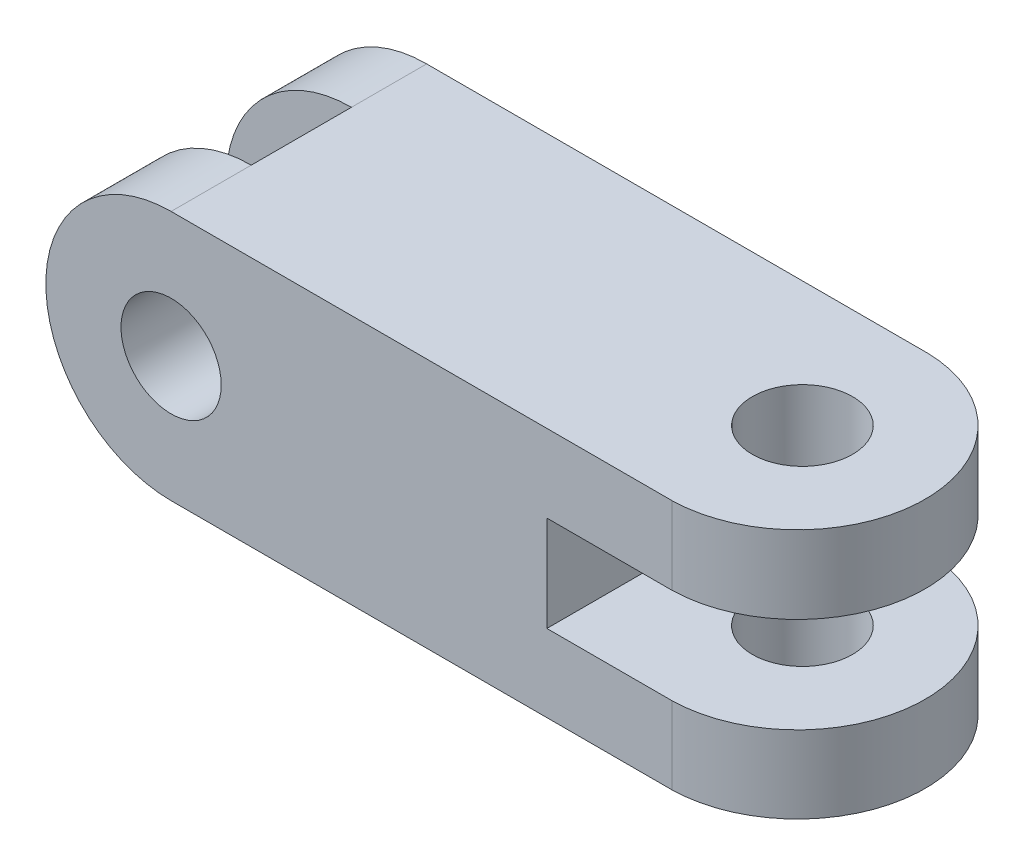
ISO-10303-21;
HEADER;
FILE_DESCRIPTION(('STEP AP214'),'2;1');
FILE_NAME('part.step','',(''),(''),'','','');
FILE_SCHEMA(('AUTOMOTIVE_DESIGN { 1 0 10303 214 1 1 1 1 }'));
ENDSEC;
DATA;
#1=APPLICATION_CONTEXT('core data for automotive mechanical design processes');
#2=APPLICATION_PROTOCOL_DEFINITION('international standard','automotive_design',2000,#1);
#3=PRODUCT_CONTEXT('',#1,'mechanical');
#4=PRODUCT('Part','Part','',(#3));
#5=PRODUCT_RELATED_PRODUCT_CATEGORY('part','',(#4));
#6=PRODUCT_DEFINITION_FORMATION('','',#4);
#7=PRODUCT_DEFINITION_CONTEXT('part definition',#1,'design');
#8=PRODUCT_DEFINITION('design','',#6,#7);
#9=PRODUCT_DEFINITION_SHAPE('','',#8);
#10=(LENGTH_UNIT() NAMED_UNIT(*) SI_UNIT(.MILLI.,.METRE.));
#11=(NAMED_UNIT(*) PLANE_ANGLE_UNIT() SI_UNIT($,.RADIAN.));
#12=(NAMED_UNIT(*) SI_UNIT($,.STERADIAN.) SOLID_ANGLE_UNIT());
#13=UNCERTAINTY_MEASURE_WITH_UNIT(LENGTH_MEASURE(1.E-05),#10,'distance_accuracy_value','');
#14=(GEOMETRIC_REPRESENTATION_CONTEXT(3) GLOBAL_UNCERTAINTY_ASSIGNED_CONTEXT((#13)) GLOBAL_UNIT_ASSIGNED_CONTEXT((#10,
#11,#12)) REPRESENTATION_CONTEXT('',''));
#15=CARTESIAN_POINT('',(0.,0.,0.));
#16=DIRECTION('',(0.,0.,1.));
#17=DIRECTION('',(1.,0.,0.));
#18=AXIS2_PLACEMENT_3D('',#15,#16,#17);
#19=CARTESIAN_POINT('',(-34.5326879287548,3.20944540727913,-0.999999999999997));
#20=DIRECTION('',(0.,1.,0.));
#21=DIRECTION('',(0.,0.,1.));
#22=AXIS2_PLACEMENT_3D('',#19,#20,#21);
#23=PLANE('',#22);
#24=CARTESIAN_POINT('',(65.4673120712452,3.20944540727913,24.));
#25=DIRECTION('',(0.,1.,0.));
#26=DIRECTION('',(0.,0.,1.));
#27=AXIS2_PLACEMENT_3D('',#24,#25,#26);
#28=CIRCLE('',#27,9.99999999999999);
#29=CARTESIAN_POINT('',(65.4673120712452,3.20944540727913,34.));
#30=VERTEX_POINT('',#29);
#31=EDGE_CURVE('E235',#30,#30,#28,.T.);
#32=ORIENTED_EDGE('',*,*,#31,.F.);
#33=EDGE_LOOP('',(#32));
#34=FACE_BOUND('',#33,.T.);
#35=CARTESIAN_POINT('',(64.9623120712452,3.20944540727913,24.5));
#36=DIRECTION('',(0.,1.,0.));
#37=DIRECTION('',(0.,0.,1.));
#38=AXIS2_PLACEMENT_3D('',#35,#36,#37);
#39=CIRCLE('',#38,25.505);
#40=CARTESIAN_POINT('',(65.4673120712454,3.20944540727913,-0.999999999999997));
#41=VERTEX_POINT('',#40);
#42=CARTESIAN_POINT('',(65.4673120712453,3.20944540727913,50.));
#43=VERTEX_POINT('',#42);
#44=EDGE_CURVE('E157',#41,#43,#39,.F.);
#45=ORIENTED_EDGE('',*,*,#44,.F.);
#46=DIRECTION('',(-1.,0.,0.));
#47=VECTOR('',#46,1.);
#48=CARTESIAN_POINT('',(-34.5326879287548,3.20944540727913,-0.999999999999997));
#49=LINE('',#48,#47);
#50=CARTESIAN_POINT('',(-34.5326879287548,3.20944540727913,-0.999999999999997));
#51=VERTEX_POINT('',#50);
#52=EDGE_CURVE('E186',#41,#51,#49,.T.);
#53=ORIENTED_EDGE('',*,*,#52,.T.);
#54=DIRECTION('',(0.,0.,1.));
#55=VECTOR('',#54,1.);
#56=CARTESIAN_POINT('',(-34.5326879287548,3.20944540727913,-0.999999999999997));
#57=LINE('',#56,#55);
#58=CARTESIAN_POINT('',(-34.5326879287548,3.20944540727913,14.));
#59=VERTEX_POINT('',#58);
#60=EDGE_CURVE('E189',#51,#59,#57,.T.);
#61=ORIENTED_EDGE('',*,*,#60,.T.);
#62=DIRECTION('',(0.,0.,1.));
#63=VECTOR('',#62,1.);
#64=CARTESIAN_POINT('',(-34.5326879287548,3.20944540727913,0.));
#65=LINE('',#64,#63);
#66=CARTESIAN_POINT('',(-34.5326879287548,3.20944540727913,34.));
#67=VERTEX_POINT('',#66);
#68=EDGE_CURVE('E220',#59,#67,#65,.T.);
#69=ORIENTED_EDGE('',*,*,#68,.T.);
#70=CARTESIAN_POINT('',(-34.5326879287548,3.20944540727913,50.));
#71=VERTEX_POINT('',#70);
#72=EDGE_CURVE('E193',#67,#71,#57,.T.);
#73=ORIENTED_EDGE('',*,*,#72,.T.);
#74=DIRECTION('',(-1.,0.,0.));
#75=VECTOR('',#74,1.);
#76=CARTESIAN_POINT('',(-34.5326879287548,3.20944540727913,50.));
#77=LINE('',#76,#75);
#78=EDGE_CURVE('E271',#43,#71,#77,.T.);
#79=ORIENTED_EDGE('',*,*,#78,.F.);
#80=EDGE_LOOP('',(#45,#53,#61,#69,#73,#79));
#81=FACE_BOUND('',#80,.T.);
#82=ADVANCED_FACE('F57',(#34,#81),#23,.T.);
#83=CARTESIAN_POINT('',(90.4673120712452,-12.2905545927209,-0.999999999999997));
#84=DIRECTION('',(0.,-1.,0.));
#85=DIRECTION('',(1.,0.,0.));
#86=AXIS2_PLACEMENT_3D('',#83,#84,#85);
#87=PLANE('',#86);
#88=CARTESIAN_POINT('',(65.4673120712452,-12.2905545927209,24.));
#89=DIRECTION('',(0.,-1.,0.));
#90=DIRECTION('',(1.,0.,0.));
#91=AXIS2_PLACEMENT_3D('',#88,#89,#90);
#92=CIRCLE('',#91,9.99999999999999);
#93=CARTESIAN_POINT('',(75.4673120712452,-12.2905545927209,24.));
#94=VERTEX_POINT('',#93);
#95=EDGE_CURVE('E252',#94,#94,#92,.T.);
#96=ORIENTED_EDGE('',*,*,#95,.F.);
#97=EDGE_LOOP('',(#96));
#98=FACE_BOUND('',#97,.T.);
#99=DIRECTION('',(1.,0.,0.));
#100=VECTOR('',#99,1.);
#101=CARTESIAN_POINT('',(90.4673120712452,-12.2905545927209,-0.999999999999997));
#102=LINE('',#101,#100);
#103=CARTESIAN_POINT('',(40.4673120712452,-12.2905545927209,-0.999999999999997));
#104=VERTEX_POINT('',#103);
#105=CARTESIAN_POINT('',(65.4673120712454,-12.2905545927209,-0.999999999999997));
#106=VERTEX_POINT('',#105);
#107=EDGE_CURVE('E183',#104,#106,#102,.T.);
#108=ORIENTED_EDGE('',*,*,#107,.T.);
#109=CARTESIAN_POINT('',(64.9623120712452,-12.2905545927209,24.5));
#110=DIRECTION('',(0.,-1.,0.));
#111=DIRECTION('',(1.,0.,0.));
#112=AXIS2_PLACEMENT_3D('',#109,#110,#111);
#113=CIRCLE('',#112,25.505);
#114=CARTESIAN_POINT('',(65.4673120712453,-12.2905545927209,50.));
#115=VERTEX_POINT('',#114);
#116=EDGE_CURVE('E243',#115,#106,#113,.F.);
#117=ORIENTED_EDGE('',*,*,#116,.F.);
#118=DIRECTION('',(1.,0.,0.));
#119=VECTOR('',#118,1.);
#120=CARTESIAN_POINT('',(90.4673120712452,-12.2905545927209,50.));
#121=LINE('',#120,#119);
#122=CARTESIAN_POINT('',(40.4673120712452,-12.2905545927209,50.));
#123=VERTEX_POINT('',#122);
#124=EDGE_CURVE('E268',#123,#115,#121,.T.);
#125=ORIENTED_EDGE('',*,*,#124,.F.);
#126=DIRECTION('',(0.,0.,1.));
#127=VECTOR('',#126,1.);
#128=CARTESIAN_POINT('',(40.4673120712452,-12.2905545927209,-0.999999999999997));
#129=LINE('',#128,#127);
#130=EDGE_CURVE('E194',#104,#123,#129,.T.);
#131=ORIENTED_EDGE('',*,*,#130,.F.);
#132=EDGE_LOOP('',(#108,#117,#125,#131));
#133=FACE_BOUND('',#132,.T.);
#134=ADVANCED_FACE('F291',(#98,#133),#87,.T.);
#135=CARTESIAN_POINT('',(40.4673120712452,-31.3735701906411,-0.999999999999997));
#136=DIRECTION('',(0.,1.,0.));
#137=DIRECTION('',(-1.,0.,0.));
#138=AXIS2_PLACEMENT_3D('',#135,#136,#137);
#139=PLANE('',#138);
#140=CARTESIAN_POINT('',(65.4673120712452,-31.3735701906411,24.));
#141=DIRECTION('',(0.,1.,0.));
#142=DIRECTION('',(-1.,0.,0.));
#143=AXIS2_PLACEMENT_3D('',#140,#141,#142);
#144=CIRCLE('',#143,9.99999999999999);
#145=CARTESIAN_POINT('',(55.4673120712452,-31.3735701906411,24.));
#146=VERTEX_POINT('',#145);
#147=EDGE_CURVE('E249',#146,#146,#144,.T.);
#148=ORIENTED_EDGE('',*,*,#147,.F.);
#149=EDGE_LOOP('',(#148));
#150=FACE_BOUND('',#149,.T.);
#151=CARTESIAN_POINT('',(64.9623120712452,-31.3735701906411,24.5));
#152=DIRECTION('',(0.,1.,0.));
#153=DIRECTION('',(-1.,0.,0.));
#154=AXIS2_PLACEMENT_3D('',#151,#152,#153);
#155=CIRCLE('',#154,25.505);
#156=CARTESIAN_POINT('',(65.4673120712454,-31.3735701906411,-0.999999999999997));
#157=VERTEX_POINT('',#156);
#158=CARTESIAN_POINT('',(65.4673120712453,-31.3735701906411,50.));
#159=VERTEX_POINT('',#158);
#160=EDGE_CURVE('E241',#157,#159,#155,.F.);
#161=ORIENTED_EDGE('',*,*,#160,.F.);
#162=DIRECTION('',(-1.,0.,0.));
#163=VECTOR('',#162,1.);
#164=CARTESIAN_POINT('',(40.4673120712452,-31.3735701906411,-0.999999999999997));
#165=LINE('',#164,#163);
#166=CARTESIAN_POINT('',(40.4673120712452,-31.3735701906411,-0.999999999999997));
#167=VERTEX_POINT('',#166);
#168=EDGE_CURVE('E167',#157,#167,#165,.T.);
#169=ORIENTED_EDGE('',*,*,#168,.T.);
#170=DIRECTION('',(0.,0.,1.));
#171=VECTOR('',#170,1.);
#172=CARTESIAN_POINT('',(40.4673120712452,-31.3735701906411,-0.999999999999997));
#173=LINE('',#172,#171);
#174=CARTESIAN_POINT('',(40.4673120712452,-31.3735701906411,50.));
#175=VERTEX_POINT('',#174);
#176=EDGE_CURVE('E196',#167,#175,#173,.T.);
#177=ORIENTED_EDGE('',*,*,#176,.T.);
#178=DIRECTION('',(-1.,0.,0.));
#179=VECTOR('',#178,1.);
#180=CARTESIAN_POINT('',(40.4673120712452,-31.3735701906411,50.));
#181=LINE('',#180,#179);
#182=EDGE_CURVE('E263',#159,#175,#181,.T.);
#183=ORIENTED_EDGE('',*,*,#182,.F.);
#184=EDGE_LOOP('',(#161,#169,#177,#183));
#185=FACE_BOUND('',#184,.T.);
#186=ADVANCED_FACE('F297',(#150,#185),#139,.T.);
#187=CARTESIAN_POINT('',(-34.5326879287548,-46.7905545927209,-0.999999999999997));
#188=DIRECTION('',(0.,-1.,0.));
#189=DIRECTION('',(0.,0.,-1.));
#190=AXIS2_PLACEMENT_3D('',#187,#188,#189);
#191=PLANE('',#190);
#192=CARTESIAN_POINT('',(65.4673120712452,-46.7905545927209,24.));
#193=DIRECTION('',(0.,1.,0.));
#194=DIRECTION('',(0.,0.,1.));
#195=AXIS2_PLACEMENT_3D('',#192,#193,#194);
#196=CIRCLE('',#195,9.99999999999999);
#197=CARTESIAN_POINT('',(65.4673120712452,-46.7905545927209,34.));
#198=VERTEX_POINT('',#197);
#199=EDGE_CURVE('E236',#198,#198,#196,.T.);
#200=ORIENTED_EDGE('',*,*,#199,.T.);
#201=EDGE_LOOP('',(#200));
#202=FACE_BOUND('',#201,.T.);
#203=DIRECTION('',(1.,0.,0.));
#204=VECTOR('',#203,1.);
#205=CARTESIAN_POINT('',(-34.5326879287548,-46.7905545927209,-0.999999999999997));
#206=LINE('',#205,#204);
#207=CARTESIAN_POINT('',(-34.5326879287548,-46.7905545927209,-0.999999999999997));
#208=VERTEX_POINT('',#207);
#209=CARTESIAN_POINT('',(65.4673120712454,-46.7905545927209,-0.999999999999997));
#210=VERTEX_POINT('',#209);
#211=EDGE_CURVE('E164',#208,#210,#206,.T.);
#212=ORIENTED_EDGE('',*,*,#211,.T.);
#213=CARTESIAN_POINT('',(64.9623120712452,-46.7905545927209,24.5));
#214=DIRECTION('',(0.,1.,0.));
#215=DIRECTION('',(0.,0.,1.));
#216=AXIS2_PLACEMENT_3D('',#213,#214,#215);
#217=CIRCLE('',#216,25.505);
#218=CARTESIAN_POINT('',(65.4673120712453,-46.7905545927209,50.));
#219=VERTEX_POINT('',#218);
#220=EDGE_CURVE('E146',#210,#219,#217,.F.);
#221=ORIENTED_EDGE('',*,*,#220,.T.);
#222=DIRECTION('',(1.,0.,0.));
#223=VECTOR('',#222,1.);
#224=CARTESIAN_POINT('',(-34.5326879287548,-46.7905545927209,50.));
#225=LINE('',#224,#223);
#226=CARTESIAN_POINT('',(-34.5326879287548,-46.7905545927209,50.));
#227=VERTEX_POINT('',#226);
#228=EDGE_CURVE('E261',#227,#219,#225,.T.);
#229=ORIENTED_EDGE('',*,*,#228,.F.);
#230=DIRECTION('',(0.,0.,1.));
#231=VECTOR('',#230,1.);
#232=CARTESIAN_POINT('',(-34.5326879287548,-46.7905545927209,-0.999999999999997));
#233=LINE('',#232,#231);
#234=CARTESIAN_POINT('',(-34.5326879287548,-46.7905545927209,34.));
#235=VERTEX_POINT('',#234);
#236=EDGE_CURVE('E188',#235,#227,#233,.T.);
#237=ORIENTED_EDGE('',*,*,#236,.F.);
#238=DIRECTION('',(0.,0.,1.));
#239=VECTOR('',#238,1.);
#240=CARTESIAN_POINT('',(-34.5326879287548,-46.7905545927209,0.));
#241=LINE('',#240,#239);
#242=CARTESIAN_POINT('',(-34.5326879287548,-46.7905545927209,14.));
#243=VERTEX_POINT('',#242);
#244=EDGE_CURVE('E229',#243,#235,#241,.T.);
#245=ORIENTED_EDGE('',*,*,#244,.F.);
#246=EDGE_CURVE('E172',#208,#243,#233,.T.);
#247=ORIENTED_EDGE('',*,*,#246,.F.);
#248=EDGE_LOOP('',(#212,#221,#229,#237,#245,#247));
#249=FACE_BOUND('',#248,.T.);
#250=ADVANCED_FACE('F169',(#202,#249),#191,.T.);
#251=CARTESIAN_POINT('',(-34.5326879287548,-21.7905545927209,-0.999999999999997));
#252=DIRECTION('',(0.,0.,1.));
#253=DIRECTION('',(1.,0.,0.));
#254=AXIS2_PLACEMENT_3D('',#251,#252,#253);
#255=CYLINDRICAL_SURFACE('',#254,25.);
#256=ORIENTED_EDGE('',*,*,#246,.T.);
#257=CARTESIAN_POINT('',(-34.5326879287548,-21.7905545927209,14.));
#258=DIRECTION('',(0.,0.,1.));
#259=DIRECTION('',(1.,0.,0.));
#260=AXIS2_PLACEMENT_3D('',#257,#258,#259);
#261=CIRCLE('',#260,25.);
#262=EDGE_CURVE('E247',#243,#59,#261,.F.);
#263=ORIENTED_EDGE('',*,*,#262,.T.);
#264=ORIENTED_EDGE('',*,*,#60,.F.);
#265=CARTESIAN_POINT('',(-34.5326879287548,-21.7905545927209,-0.999999999999997));
#266=DIRECTION('',(0.,0.,1.));
#267=DIRECTION('',(1.,0.,0.));
#268=AXIS2_PLACEMENT_3D('',#265,#266,#267);
#269=CIRCLE('',#268,25.);
#270=EDGE_CURVE('E173',#51,#208,#269,.T.);
#271=ORIENTED_EDGE('',*,*,#270,.T.);
#272=EDGE_LOOP('',(#256,#263,#264,#271));
#273=FACE_BOUND('',#272,.T.);
#274=ADVANCED_FACE('F278',(#273),#255,.T.);
#275=CARTESIAN_POINT('',(-34.5326879287548,-21.7905545927209,-0.999999999999997));
#276=DIRECTION('',(0.,0.,1.));
#277=DIRECTION('',(1.,0.,0.));
#278=AXIS2_PLACEMENT_3D('',#275,#276,#277);
#279=CYLINDRICAL_SURFACE('',#278,10.);
#280=CARTESIAN_POINT('',(-34.5326879287548,-21.7905545927209,50.));
#281=DIRECTION('',(0.,0.,1.));
#282=DIRECTION('',(1.,0.,0.));
#283=AXIS2_PLACEMENT_3D('',#280,#281,#282);
#284=CIRCLE('',#283,10.);
#285=CARTESIAN_POINT('',(-24.5326879287548,-21.7905545927209,50.));
#286=VERTEX_POINT('',#285);
#287=EDGE_CURVE('E255',#286,#286,#284,.T.);
#288=ORIENTED_EDGE('',*,*,#287,.T.);
#289=EDGE_LOOP('',(#288));
#290=FACE_BOUND('',#289,.T.);
#291=CARTESIAN_POINT('',(-34.5326879287548,-21.7905545927209,-0.999999999999997));
#292=DIRECTION('',(0.,0.,1.));
#293=DIRECTION('',(1.,0.,0.));
#294=AXIS2_PLACEMENT_3D('',#291,#292,#293);
#295=CIRCLE('',#294,10.);
#296=CARTESIAN_POINT('',(-24.5326879287548,-21.7905545927209,-0.999999999999997));
#297=VERTEX_POINT('',#296);
#298=EDGE_CURVE('E177',#297,#297,#295,.T.);
#299=ORIENTED_EDGE('',*,*,#298,.F.);
#300=EDGE_LOOP('',(#299));
#301=FACE_BOUND('',#300,.T.);
#302=CARTESIAN_POINT('',(-34.5326879287548,-21.7905545927209,14.));
#303=DIRECTION('',(0.,0.,1.));
#304=DIRECTION('',(1.,0.,0.));
#305=AXIS2_PLACEMENT_3D('',#302,#303,#304);
#306=CIRCLE('',#305,10.);
#307=CARTESIAN_POINT('',(-34.5326879287548,-31.7905545927209,14.));
#308=VERTEX_POINT('',#307);
#309=CARTESIAN_POINT('',(-34.5326879287548,-11.7905545927209,14.));
#310=VERTEX_POINT('',#309);
#311=EDGE_CURVE('E65',#308,#310,#306,.F.);
#312=ORIENTED_EDGE('',*,*,#311,.F.);
#313=DIRECTION('',(0.,0.,1.));
#314=VECTOR('',#313,1.);
#315=CARTESIAN_POINT('',(-34.5326879287548,-31.7905545927209,-0.999999999999997));
#316=LINE('',#315,#314);
#317=CARTESIAN_POINT('',(-34.5326879287548,-31.7905545927209,34.));
#318=VERTEX_POINT('',#317);
#319=EDGE_CURVE('E206',#318,#308,#316,.F.);
#320=ORIENTED_EDGE('',*,*,#319,.F.);
#321=CARTESIAN_POINT('',(-34.5326879287548,-21.7905545927209,34.));
#322=DIRECTION('',(0.,0.,1.));
#323=DIRECTION('',(1.,0.,0.));
#324=AXIS2_PLACEMENT_3D('',#321,#322,#323);
#325=CIRCLE('',#324,10.);
#326=CARTESIAN_POINT('',(-34.5326879287548,-11.7905545927209,34.));
#327=VERTEX_POINT('',#326);
#328=EDGE_CURVE('E201',#318,#327,#325,.F.);
#329=ORIENTED_EDGE('',*,*,#328,.T.);
#330=DIRECTION('',(0.,0.,1.));
#331=VECTOR('',#330,1.);
#332=CARTESIAN_POINT('',(-34.5326879287548,-11.7905545927209,-0.999999999999997));
#333=LINE('',#332,#331);
#334=EDGE_CURVE('E204',#310,#327,#333,.T.);
#335=ORIENTED_EDGE('',*,*,#334,.F.);
#336=EDGE_LOOP('',(#312,#320,#329,#335));
#337=FACE_BOUND('',#336,.T.);
#338=ADVANCED_FACE('F223',(#290,#301,#337),#279,.F.);
#339=CARTESIAN_POINT('',(-34.5326879287548,-21.7905545927209,34.));
#340=DIRECTION('',(0.,0.,1.));
#341=DIRECTION('',(1.,0.,0.));
#342=AXIS2_PLACEMENT_3D('',#339,#340,#341);
#343=CIRCLE('',#342,25.);
#344=EDGE_CURVE('E245',#235,#67,#343,.F.);
#345=ORIENTED_EDGE('',*,*,#344,.F.);
#346=ORIENTED_EDGE('',*,*,#236,.T.);
#347=CARTESIAN_POINT('',(-34.5326879287548,-21.7905545927209,50.));
#348=DIRECTION('',(0.,0.,1.));
#349=DIRECTION('',(1.,0.,0.));
#350=AXIS2_PLACEMENT_3D('',#347,#348,#349);
#351=CIRCLE('',#350,25.);
#352=EDGE_CURVE('E258',#71,#227,#351,.T.);
#353=ORIENTED_EDGE('',*,*,#352,.F.);
#354=ORIENTED_EDGE('',*,*,#72,.F.);
#355=EDGE_LOOP('',(#345,#346,#353,#354));
#356=FACE_BOUND('',#355,.T.);
#357=ADVANCED_FACE('F59',(#356),#255,.T.);
#358=CARTESIAN_POINT('',(40.4673120712452,-12.2905545927209,-0.999999999999997));
#359=DIRECTION('',(1.,0.,0.));
#360=DIRECTION('',(0.,0.,-1.));
#361=AXIS2_PLACEMENT_3D('',#358,#359,#360);
#362=PLANE('',#361);
#363=ORIENTED_EDGE('',*,*,#130,.T.);
#364=DIRECTION('',(0.,1.,0.));
#365=VECTOR('',#364,1.);
#366=CARTESIAN_POINT('',(40.4673120712452,-12.2905545927209,50.));
#367=LINE('',#366,#365);
#368=EDGE_CURVE('E265',#175,#123,#367,.T.);
#369=ORIENTED_EDGE('',*,*,#368,.F.);
#370=ORIENTED_EDGE('',*,*,#176,.F.);
#371=DIRECTION('',(0.,1.,0.));
#372=VECTOR('',#371,1.);
#373=CARTESIAN_POINT('',(40.4673120712452,-12.2905545927209,-0.999999999999997));
#374=LINE('',#373,#372);
#375=EDGE_CURVE('E175',#167,#104,#374,.T.);
#376=ORIENTED_EDGE('',*,*,#375,.T.);
#377=EDGE_LOOP('',(#363,#369,#370,#376));
#378=FACE_BOUND('',#377,.T.);
#379=ADVANCED_FACE('F285',(#378),#362,.T.);
#380=CARTESIAN_POINT('',(-34.5326879287548,-21.7905545927209,-0.999999999999997));
#381=DIRECTION('',(0.,0.,1.));
#382=DIRECTION('',(1.,0.,0.));
#383=AXIS2_PLACEMENT_3D('',#380,#381,#382);
#384=PLANE('',#383);
#385=ORIENTED_EDGE('',*,*,#298,.T.);
#386=EDGE_LOOP('',(#385));
#387=FACE_BOUND('',#386,.T.);
#388=ORIENTED_EDGE('',*,*,#52,.F.);
#389=DIRECTION('',(0.,1.,0.));
#390=VECTOR('',#389,1.);
#391=CARTESIAN_POINT('',(65.4673120712454,-46.7905545927209,-0.999999999999997));
#392=LINE('',#391,#390);
#393=EDGE_CURVE('E12',#41,#106,#392,.F.);
#394=ORIENTED_EDGE('',*,*,#393,.T.);
#395=ORIENTED_EDGE('',*,*,#107,.F.);
#396=ORIENTED_EDGE('',*,*,#375,.F.);
#397=ORIENTED_EDGE('',*,*,#168,.F.);
#398=DIRECTION('',(0.,1.,0.));
#399=VECTOR('',#398,1.);
#400=CARTESIAN_POINT('',(65.4673120712454,-46.7905545927209,-0.999999999999997));
#401=LINE('',#400,#399);
#402=EDGE_CURVE('E149',#210,#157,#401,.T.);
#403=ORIENTED_EDGE('',*,*,#402,.F.);
#404=ORIENTED_EDGE('',*,*,#211,.F.);
#405=ORIENTED_EDGE('',*,*,#270,.F.);
#406=EDGE_LOOP('',(#388,#394,#395,#396,#397,#403,#404,#405));
#407=FACE_BOUND('',#406,.T.);
#408=ADVANCED_FACE('F162',(#387,#407),#384,.F.);
#409=CARTESIAN_POINT('',(-34.5326879287548,-21.7905545927209,50.));
#410=DIRECTION('',(0.,0.,1.));
#411=DIRECTION('',(1.,0.,0.));
#412=AXIS2_PLACEMENT_3D('',#409,#410,#411);
#413=PLANE('',#412);
#414=DIRECTION('',(0.,1.,0.));
#415=VECTOR('',#414,1.);
#416=CARTESIAN_POINT('',(65.4673120712453,-46.7905545927209,50.));
#417=LINE('',#416,#415);
#418=EDGE_CURVE('E192',#43,#115,#417,.F.);
#419=ORIENTED_EDGE('',*,*,#418,.F.);
#420=ORIENTED_EDGE('',*,*,#78,.T.);
#421=ORIENTED_EDGE('',*,*,#352,.T.);
#422=ORIENTED_EDGE('',*,*,#228,.T.);
#423=DIRECTION('',(0.,1.,0.));
#424=VECTOR('',#423,1.);
#425=CARTESIAN_POINT('',(65.4673120712453,-46.7905545927209,50.));
#426=LINE('',#425,#424);
#427=EDGE_CURVE('E152',#219,#159,#426,.T.);
#428=ORIENTED_EDGE('',*,*,#427,.T.);
#429=ORIENTED_EDGE('',*,*,#182,.T.);
#430=ORIENTED_EDGE('',*,*,#368,.T.);
#431=ORIENTED_EDGE('',*,*,#124,.T.);
#432=EDGE_LOOP('',(#419,#420,#421,#422,#428,#429,#430,#431));
#433=FACE_BOUND('',#432,.T.);
#434=ORIENTED_EDGE('',*,*,#287,.F.);
#435=EDGE_LOOP('',(#434));
#436=FACE_BOUND('',#435,.T.);
#437=ADVANCED_FACE('F326',(#433,#436),#413,.T.);
#438=CARTESIAN_POINT('',(64.9623120712452,-46.7905545927209,24.5));
#439=DIRECTION('',(0.,1.,0.));
#440=DIRECTION('',(0.,0.,1.));
#441=AXIS2_PLACEMENT_3D('',#438,#439,#440);
#442=CYLINDRICAL_SURFACE('',#441,25.505);
#443=ORIENTED_EDGE('',*,*,#160,.T.);
#444=ORIENTED_EDGE('',*,*,#427,.F.);
#445=ORIENTED_EDGE('',*,*,#220,.F.);
#446=ORIENTED_EDGE('',*,*,#402,.T.);
#447=EDGE_LOOP('',(#443,#444,#445,#446));
#448=FACE_BOUND('',#447,.T.);
#449=ADVANCED_FACE('F148',(#448),#442,.T.);
#450=ORIENTED_EDGE('',*,*,#116,.T.);
#451=ORIENTED_EDGE('',*,*,#393,.F.);
#452=ORIENTED_EDGE('',*,*,#44,.T.);
#453=ORIENTED_EDGE('',*,*,#418,.T.);
#454=EDGE_LOOP('',(#450,#451,#452,#453));
#455=FACE_BOUND('',#454,.T.);
#456=ADVANCED_FACE('F333',(#455),#442,.T.);
#457=CARTESIAN_POINT('',(0.,-46.7905545927209,14.));
#458=DIRECTION('',(0.,0.,1.));
#459=DIRECTION('',(1.,0.,0.));
#460=AXIS2_PLACEMENT_3D('',#457,#458,#459);
#461=PLANE('',#460);
#462=DIRECTION('',(0.,1.,0.));
#463=VECTOR('',#462,1.);
#464=CARTESIAN_POINT('',(-34.5326879287548,-46.7905545927209,14.));
#465=LINE('',#464,#463);
#466=EDGE_CURVE('E72',#243,#308,#465,.T.);
#467=ORIENTED_EDGE('',*,*,#466,.T.);
#468=ORIENTED_EDGE('',*,*,#311,.T.);
#469=EDGE_CURVE('E212',#310,#59,#465,.T.);
#470=ORIENTED_EDGE('',*,*,#469,.T.);
#471=ORIENTED_EDGE('',*,*,#262,.F.);
#472=EDGE_LOOP('',(#467,#468,#470,#471));
#473=FACE_BOUND('',#472,.T.);
#474=ADVANCED_FACE('F211',(#473),#461,.T.);
#475=CARTESIAN_POINT('',(-34.5326879287548,-46.7905545927209,0.));
#476=DIRECTION('',(-1.,0.,0.));
#477=DIRECTION('',(0.,0.,1.));
#478=AXIS2_PLACEMENT_3D('',#475,#476,#477);
#479=PLANE('',#478);
#480=ORIENTED_EDGE('',*,*,#319,.T.);
#481=ORIENTED_EDGE('',*,*,#466,.F.);
#482=ORIENTED_EDGE('',*,*,#244,.T.);
#483=DIRECTION('',(0.,1.,0.));
#484=VECTOR('',#483,1.);
#485=CARTESIAN_POINT('',(-34.5326879287548,-46.7905545927209,34.));
#486=LINE('',#485,#484);
#487=EDGE_CURVE('E221',#235,#318,#486,.T.);
#488=ORIENTED_EDGE('',*,*,#487,.T.);
#489=EDGE_LOOP('',(#480,#481,#482,#488));
#490=FACE_BOUND('',#489,.T.);
#491=ADVANCED_FACE('F228',(#490),#479,.T.);
#492=ORIENTED_EDGE('',*,*,#334,.T.);
#493=EDGE_CURVE('E80',#327,#67,#486,.T.);
#494=ORIENTED_EDGE('',*,*,#493,.T.);
#495=ORIENTED_EDGE('',*,*,#68,.F.);
#496=ORIENTED_EDGE('',*,*,#469,.F.);
#497=EDGE_LOOP('',(#492,#494,#495,#496));
#498=FACE_BOUND('',#497,.T.);
#499=ADVANCED_FACE('F218',(#498),#479,.T.);
#500=CARTESIAN_POINT('',(0.,-46.7905545927209,34.));
#501=DIRECTION('',(0.,0.,1.));
#502=DIRECTION('',(1.,0.,0.));
#503=AXIS2_PLACEMENT_3D('',#500,#501,#502);
#504=PLANE('',#503);
#505=ORIENTED_EDGE('',*,*,#344,.T.);
#506=ORIENTED_EDGE('',*,*,#493,.F.);
#507=ORIENTED_EDGE('',*,*,#328,.F.);
#508=ORIENTED_EDGE('',*,*,#487,.F.);
#509=EDGE_LOOP('',(#505,#506,#507,#508));
#510=FACE_BOUND('',#509,.T.);
#511=ADVANCED_FACE('F226',(#510),#504,.F.);
#512=CARTESIAN_POINT('',(65.4673120712452,-46.7905545927209,24.));
#513=DIRECTION('',(0.,1.,0.));
#514=DIRECTION('',(0.,0.,1.));
#515=AXIS2_PLACEMENT_3D('',#512,#513,#514);
#516=CYLINDRICAL_SURFACE('',#515,9.99999999999999);
#517=ORIENTED_EDGE('',*,*,#147,.T.);
#518=EDGE_LOOP('',(#517));
#519=FACE_BOUND('',#518,.T.);
#520=ORIENTED_EDGE('',*,*,#199,.F.);
#521=EDGE_LOOP('',(#520));
#522=FACE_BOUND('',#521,.T.);
#523=ADVANCED_FACE('F314',(#519,#522),#516,.F.);
#524=ORIENTED_EDGE('',*,*,#95,.T.);
#525=EDGE_LOOP('',(#524));
#526=FACE_BOUND('',#525,.T.);
#527=ORIENTED_EDGE('',*,*,#31,.T.);
#528=EDGE_LOOP('',(#527));
#529=FACE_BOUND('',#528,.T.);
#530=ADVANCED_FACE('F316',(#526,#529),#516,.F.);
#531=CLOSED_SHELL('',(#82,#134,#186,#250,#274,#338,#357,#379,#408,#437,#449,#456,#474,#491,#499,
#511,#523,#530));
#532=MANIFOLD_SOLID_BREP('B2',#531);
#533=ADVANCED_BREP_SHAPE_REPRESENTATION('',(#18,#532),#14);
#534=SHAPE_DEFINITION_REPRESENTATION(#9,#533);
ENDSEC;
END-ISO-10303-21;
